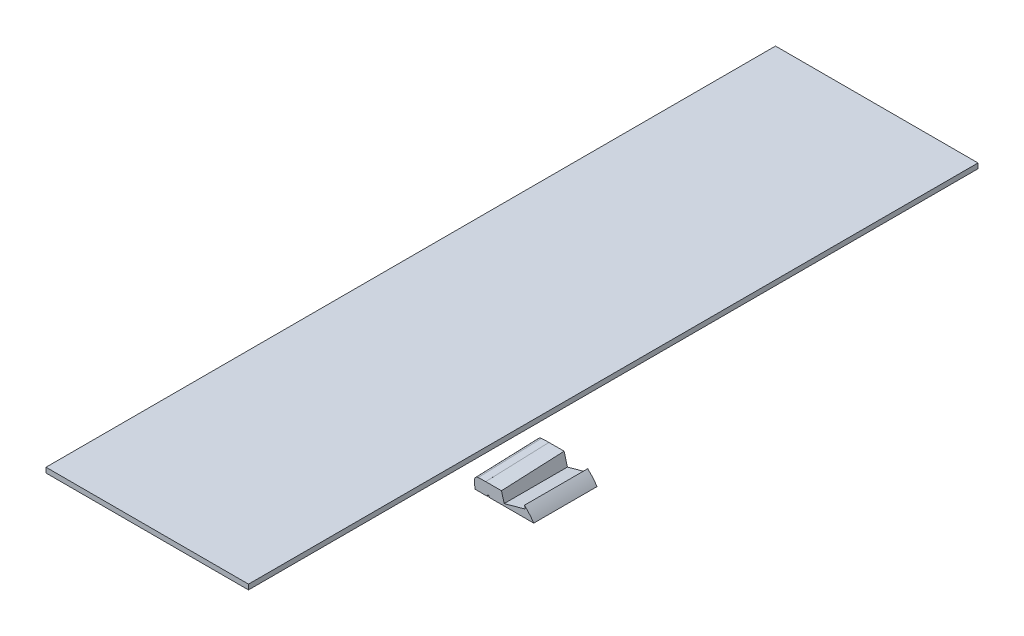
ISO-10303-21;
HEADER;
FILE_DESCRIPTION(('STEP AP214'),'2;1');
FILE_NAME('part.step','',(''),(''),'','','');
FILE_SCHEMA(('AUTOMOTIVE_DESIGN { 1 0 10303 214 1 1 1 1 }'));
ENDSEC;
DATA;
#1=APPLICATION_CONTEXT('core data for automotive mechanical design processes');
#2=APPLICATION_PROTOCOL_DEFINITION('international standard','automotive_design',2000,#1);
#3=PRODUCT_CONTEXT('',#1,'mechanical');
#4=PRODUCT('Part','Part','',(#3));
#5=PRODUCT_RELATED_PRODUCT_CATEGORY('part','',(#4));
#6=PRODUCT_DEFINITION_FORMATION('','',#4);
#7=PRODUCT_DEFINITION_CONTEXT('part definition',#1,'design');
#8=PRODUCT_DEFINITION('design','',#6,#7);
#9=PRODUCT_DEFINITION_SHAPE('','',#8);
#10=(LENGTH_UNIT() NAMED_UNIT(*) SI_UNIT(.MILLI.,.METRE.));
#11=(NAMED_UNIT(*) PLANE_ANGLE_UNIT() SI_UNIT($,.RADIAN.));
#12=(NAMED_UNIT(*) SI_UNIT($,.STERADIAN.) SOLID_ANGLE_UNIT());
#13=UNCERTAINTY_MEASURE_WITH_UNIT(LENGTH_MEASURE(1.E-05),#10,'distance_accuracy_value','');
#14=(GEOMETRIC_REPRESENTATION_CONTEXT(3) GLOBAL_UNCERTAINTY_ASSIGNED_CONTEXT((#13)) GLOBAL_UNIT_ASSIGNED_CONTEXT((#10,
#11,#12)) REPRESENTATION_CONTEXT('',''));
#15=CARTESIAN_POINT('',(0.,0.,0.));
#16=DIRECTION('',(0.,0.,1.));
#17=DIRECTION('',(1.,0.,0.));
#18=AXIS2_PLACEMENT_3D('',#15,#16,#17);
#19=CARTESIAN_POINT('',(38.8064860248671,394.0012038353,482.120102696812));
#20=DIRECTION('',(0.964308162620724,0.2647824909299,0.));
#21=DIRECTION('',(-0.2647824909299,0.964308162620724,0.));
#22=AXIS2_PLACEMENT_3D('',#19,#20,#21);
#23=PLANE('',#22);
#24=DIRECTION('',(0.,0.,1.));
#25=VECTOR('',#24,1.);
#26=CARTESIAN_POINT('',(116.345470624094,111.612910305147,-50.4145633031884));
#27=LINE('',#26,#25);
#28=CARTESIAN_POINT('',(116.345470624094,111.612910305147,-0.906787209581206));
#29=VERTEX_POINT('',#28);
#30=CARTESIAN_POINT('',(116.345470624094,111.612910305147,124.093212790419));
#31=VERTEX_POINT('',#30);
#32=EDGE_CURVE('E598',#29,#31,#27,.T.);
#33=ORIENTED_EDGE('',*,*,#32,.F.);
#34=DIRECTION('',(-0.2647824909299,0.964308162620724,0.));
#35=VECTOR('',#34,1.);
#36=CARTESIAN_POINT('',(38.8064860248671,394.0012038353,-0.906787209581206));
#37=LINE('',#36,#35);
#38=CARTESIAN_POINT('',(109.793096732768,135.475921812285,-0.906787209581227));
#39=VERTEX_POINT('',#38);
#40=EDGE_CURVE('E538',#29,#39,#37,.T.);
#41=ORIENTED_EDGE('',*,*,#40,.T.);
#42=CARTESIAN_POINT('',(109.753405284803,135.620473618277,-5.23468981717832));
#43=CARTESIAN_POINT('',(109.859389161119,135.234492216415,6.36334958936649));
#44=CARTESIAN_POINT('',(109.968473912636,134.837217774529,17.960976204007));
#45=CARTESIAN_POINT('',(110.191608713052,134.024585834063,41.1555083415589));
#46=CARTESIAN_POINT('',(110.305658744404,133.609228399388,52.7524138668736));
#47=CARTESIAN_POINT('',(110.5374882961,132.764931149021,75.9456780913623));
#48=CARTESIAN_POINT('',(110.655267812523,132.33599134761,87.5420367910984));
#49=CARTESIAN_POINT('',(110.893324143082,131.469016866347,110.734387183022));
#50=CARTESIAN_POINT('',(111.013600957132,131.030982186808,122.330378875221));
#51=CARTESIAN_POINT('',(111.255420185839,130.150303652129,145.522173363155));
#52=CARTESIAN_POINT('',(111.376962600501,129.707659796972,157.11797615889));
#53=CARTESIAN_POINT('',(111.620080541348,128.822251498203,180.309571512638));
#54=CARTESIAN_POINT('',(111.741656067517,128.379487054646,191.905364070655));
#55=CARTESIAN_POINT('',(111.983605853896,127.498333043556,215.097182801119));
#56=CARTESIAN_POINT('',(112.103980108491,127.059943496468,226.693208974403));
#57=CARTESIAN_POINT('',(112.342287225985,126.19205567729,249.885598553668));
#58=CARTESIAN_POINT('',(112.460220093464,125.762557388518,261.481961958975));
#59=CARTESIAN_POINT('',(112.692399143381,124.916987304792,284.675195414121));
#60=CARTESIAN_POINT('',(112.806645332728,124.500915484678,296.27206546297));
#61=CARTESIAN_POINT('',(113.030197847382,123.686762275762,319.466482028005));
#62=CARTESIAN_POINT('',(113.139504174712,123.288680879593,331.064028543912));
#63=CARTESIAN_POINT('',(113.351915343806,122.515103202801,354.259971588434));
#64=CARTESIAN_POINT('',(113.455020166764,122.139606990664,365.858368119519));
#65=CARTESIAN_POINT('',(113.653752060195,121.415847703049,389.056177246248));
#66=CARTESIAN_POINT('',(113.749379063485,121.067584872239,400.655589850082));
#67=CARTESIAN_POINT('',(113.840628259898,120.735265523539,412.255506908933));
#68=B_SPLINE_CURVE_WITH_KNOTS('',3,(#42,#43,#44,#45,#46,#47,#48,#49,#50,#51,#52,#53,#54,#55,#56,
#57,#58,#59,#60,#61,#62,#63,#64,#65,#66,#67),.UNSPECIFIED.,.F.,.F.,(4,2,2,2,2,2,2,2,2,2,2,2,4),
(0.,34.8148147103214,69.6295063951828,104.44416147604,139.25881536091,174.073469365323,
208.888107520512,243.702908296918,278.517643749172,313.332313958682,348.146969911807,
382.96173142915,417.776805691255),.UNSPECIFIED.);
#69=CARTESIAN_POINT('',(111.032147749001,130.96343684902,124.093212790419));
#70=VERTEX_POINT('',#69);
#71=EDGE_CURVE('E606',#39,#70,#68,.T.);
#72=ORIENTED_EDGE('',*,*,#71,.T.);
#73=DIRECTION('',(-0.2647824909299,0.964308162620724,0.));
#74=VECTOR('',#73,1.);
#75=CARTESIAN_POINT('',(38.8064860248671,394.0012038353,124.093212790419));
#76=LINE('',#75,#74);
#77=EDGE_CURVE('E569',#31,#70,#76,.T.);
#78=ORIENTED_EDGE('',*,*,#77,.F.);
#79=EDGE_LOOP('',(#33,#41,#72,#78));
#80=FACE_BOUND('',#79,.T.);
#81=ADVANCED_FACE('F341',(#80),#23,.T.);
#82=CARTESIAN_POINT('',(60.399869582043,50.092896258677,-548.050105014357));
#83=DIRECTION('',(0.999405965304478,0.0344632632497941,0.));
#84=DIRECTION('',(-0.0344632632497941,0.999405965304478,0.));
#85=AXIS2_PLACEMENT_3D('',#82,#83,#84);
#86=PLANE('',#85);
#87=DIRECTION('',(-0.0344632632497941,0.999405965304478,0.));
#88=VECTOR('',#87,1.);
#89=CARTESIAN_POINT('',(60.3998695820434,50.092896258677,-0.906787209581261));
#90=LINE('',#89,#88);
#91=CARTESIAN_POINT('',(58.4241385961298,107.387451299709,-0.906787209581261));
#92=VERTEX_POINT('',#91);
#93=CARTESIAN_POINT('',(57.7388846588507,127.259245438914,-0.906787209581261));
#94=VERTEX_POINT('',#93);
#95=EDGE_CURVE('E554',#92,#94,#90,.T.);
#96=ORIENTED_EDGE('',*,*,#95,.F.);
#97=DIRECTION('',(0.,0.,-1.));
#98=VECTOR('',#97,1.);
#99=CARTESIAN_POINT('',(58.4241385961295,107.387451299709,-548.050105014357));
#100=LINE('',#99,#98);
#101=CARTESIAN_POINT('',(58.4241385961295,107.387451299709,124.093212790419));
#102=VERTEX_POINT('',#101);
#103=EDGE_CURVE('E595',#102,#92,#100,.T.);
#104=ORIENTED_EDGE('',*,*,#103,.F.);
#105=DIRECTION('',(-0.0344632632497941,0.999405965304478,0.));
#106=VECTOR('',#105,1.);
#107=CARTESIAN_POINT('',(60.3998695820434,50.092896258677,124.093212790419));
#108=LINE('',#107,#106);
#109=CARTESIAN_POINT('',(57.8925702321294,122.802491660183,124.093212790419));
#110=VERTEX_POINT('',#109);
#111=EDGE_CURVE('E582',#102,#110,#108,.T.);
#112=ORIENTED_EDGE('',*,*,#111,.T.);
#113=DIRECTION('',(-0.00122870293653162,0.0356313630388315,-0.999364246036994));
#114=VECTOR('',#113,1.);
#115=CARTESIAN_POINT('',(57.0704178479695,146.644226877269,-544.603567444162));
#116=LINE('',#115,#114);
#117=EDGE_CURVE('E652',#110,#94,#116,.T.);
#118=ORIENTED_EDGE('',*,*,#117,.T.);
#119=EDGE_LOOP('',(#96,#104,#112,#118));
#120=FACE_BOUND('',#119,.T.);
#121=ADVANCED_FACE('F624',(#120),#86,.F.);
#122=CARTESIAN_POINT('',(155.443997278197,129.814876418465,1178.1644683725));
#123=CARTESIAN_POINT('',(196.657509568503,92.1237405424365,1178.1644683725));
#124=CARTESIAN_POINT('',(192.258596174472,34.9150214858441,1178.1644683725));
#125=B_SPLINE_CURVE_WITH_KNOTS('',2,(#122,#123,#124),.UNSPECIFIED.,.F.,.F.,(3,3),(0.,1.),.UNSPECIFIED.);
#126=DIRECTION('',(0.,0.,-1.));
#127=VECTOR('',#126,1.);
#128=SURFACE_OF_LINEAR_EXTRUSION('',#125,#127);
#129=DIRECTION('',(0.,0.,-1.));
#130=VECTOR('',#129,1.);
#131=CARTESIAN_POINT('',(174.808942224235,107.387451299709,29.6657032982748));
#132=LINE('',#131,#130);
#133=CARTESIAN_POINT('',(174.808942224187,107.387451299782,124.093212790419));
#134=VERTEX_POINT('',#133);
#135=CARTESIAN_POINT('',(174.808942224187,107.387451299782,-0.90678720958115));
#136=VERTEX_POINT('',#135);
#137=EDGE_CURVE('E592',#134,#136,#132,.T.);
#138=ORIENTED_EDGE('',*,*,#137,.T.);
#139=CARTESIAN_POINT('',(155.443997278197,129.814876418465,-0.90678720958115));
#140=CARTESIAN_POINT('',(196.657509568503,92.1237405424365,-0.90678720958115));
#141=CARTESIAN_POINT('',(192.258596174472,34.9150214858441,-0.90678720958115));
#142=B_SPLINE_CURVE_WITH_KNOTS('',2,(#139,#140,#141),.UNSPECIFIED.,.F.,.F.,(3,3),(0.,1.),.UNSPECIFIED.);
#143=CARTESIAN_POINT('',(156.447540783786,128.887901600093,-0.906787209581206));
#144=VERTEX_POINT('',#143);
#145=EDGE_CURVE('E549',#136,#144,#142,.F.);
#146=ORIENTED_EDGE('',*,*,#145,.T.);
#147=DIRECTION('',(0.,0.,-1.));
#148=VECTOR('',#147,1.);
#149=CARTESIAN_POINT('',(156.447540783786,128.887901600093,-18.0163537751292));
#150=LINE('',#149,#148);
#151=CARTESIAN_POINT('',(156.447540783786,128.887901600093,124.093212790419));
#152=VERTEX_POINT('',#151);
#153=EDGE_CURVE('E603',#152,#144,#150,.T.);
#154=ORIENTED_EDGE('',*,*,#153,.F.);
#155=CARTESIAN_POINT('',(155.443997278197,129.814876418465,124.093212790419));
#156=CARTESIAN_POINT('',(196.657509568503,92.1237405424365,124.093212790419));
#157=CARTESIAN_POINT('',(192.258596174472,34.9150214858441,124.093212790419));
#158=B_SPLINE_CURVE_WITH_KNOTS('',2,(#155,#156,#157),.UNSPECIFIED.,.F.,.F.,(3,3),(0.,1.),.UNSPECIFIED.);
#159=EDGE_CURVE('E565',#134,#152,#158,.F.);
#160=ORIENTED_EDGE('',*,*,#159,.F.);
#161=EDGE_LOOP('',(#138,#146,#154,#160));
#162=FACE_BOUND('',#161,.T.);
#163=ADVANCED_FACE('F630',(#162),#128,.T.);
#164=CARTESIAN_POINT('',(0.,107.387451299709,0.));
#165=DIRECTION('',(0.,-1.,0.));
#166=DIRECTION('',(0.,0.,-1.));
#167=AXIS2_PLACEMENT_3D('',#164,#165,#166);
#168=PLANE('',#167);
#169=DIRECTION('',(0.,0.,-1.));
#170=VECTOR('',#169,1.);
#171=CARTESIAN_POINT('',(85.608617664449,107.387451299709,4.09321279041879));
#172=LINE('',#171,#170);
#173=CARTESIAN_POINT('',(85.608617664449,107.387451299709,4.09321279041879));
#174=VERTEX_POINT('',#173);
#175=CARTESIAN_POINT('',(85.608617664449,107.387451299709,-0.906787209581206));
#176=VERTEX_POINT('',#175);
#177=EDGE_CURVE('E469',#174,#176,#172,.T.);
#178=ORIENTED_EDGE('',*,*,#177,.T.);
#179=DIRECTION('',(1.,0.,0.));
#180=VECTOR('',#179,1.);
#181=CARTESIAN_POINT('',(0.,107.387451299709,-0.906787209581206));
#182=LINE('',#181,#180);
#183=EDGE_CURVE('E559',#176,#136,#182,.T.);
#184=ORIENTED_EDGE('',*,*,#183,.T.);
#185=ORIENTED_EDGE('',*,*,#137,.F.);
#186=DIRECTION('',(1.,0.,0.));
#187=VECTOR('',#186,1.);
#188=CARTESIAN_POINT('',(0.,107.387451299709,124.093212790419));
#189=LINE('',#188,#187);
#190=CARTESIAN_POINT('',(86.2281431725654,107.387451299709,124.093212790419));
#191=VERTEX_POINT('',#190);
#192=EDGE_CURVE('E578',#191,#134,#189,.T.);
#193=ORIENTED_EDGE('',*,*,#192,.F.);
#194=DIRECTION('',(0.,0.,1.));
#195=VECTOR('',#194,1.);
#196=CARTESIAN_POINT('',(86.2281431725654,107.387451299709,119.093212790419));
#197=LINE('',#196,#195);
#198=CARTESIAN_POINT('',(86.2281431725654,107.387451299709,119.093212790419));
#199=VERTEX_POINT('',#198);
#200=EDGE_CURVE('E526',#199,#191,#197,.T.);
#201=ORIENTED_EDGE('',*,*,#200,.F.);
#202=DIRECTION('',(1.,0.,0.));
#203=VECTOR('',#202,1.);
#204=CARTESIAN_POINT('',(83.2281431725654,107.387451299709,119.093212790419));
#205=LINE('',#204,#203);
#206=CARTESIAN_POINT('',(83.2281431725654,107.387451299709,119.093212790419));
#207=VERTEX_POINT('',#206);
#208=EDGE_CURVE('E517',#207,#199,#205,.T.);
#209=ORIENTED_EDGE('',*,*,#208,.F.);
#210=DIRECTION('',(0.,0.,1.));
#211=VECTOR('',#210,1.);
#212=CARTESIAN_POINT('',(83.2281431725654,107.387451299709,119.093212790419));
#213=LINE('',#212,#211);
#214=CARTESIAN_POINT('',(83.2281431725654,107.387451299709,124.093212790419));
#215=VERTEX_POINT('',#214);
#216=EDGE_CURVE('E529',#207,#215,#213,.T.);
#217=ORIENTED_EDGE('',*,*,#216,.T.);
#218=EDGE_CURVE('E579',#102,#215,#189,.T.);
#219=ORIENTED_EDGE('',*,*,#218,.F.);
#220=ORIENTED_EDGE('',*,*,#103,.T.);
#221=CARTESIAN_POINT('',(82.608617664449,107.387451299709,-0.906787209581206));
#222=VERTEX_POINT('',#221);
#223=EDGE_CURVE('E560',#92,#222,#182,.T.);
#224=ORIENTED_EDGE('',*,*,#223,.T.);
#225=DIRECTION('',(0.,0.,-1.));
#226=VECTOR('',#225,1.);
#227=CARTESIAN_POINT('',(82.608617664449,107.387451299709,4.09321279041879));
#228=LINE('',#227,#226);
#229=CARTESIAN_POINT('',(82.608617664449,107.387451299709,4.09321279041879));
#230=VERTEX_POINT('',#229);
#231=EDGE_CURVE('E356',#230,#222,#228,.T.);
#232=ORIENTED_EDGE('',*,*,#231,.F.);
#233=DIRECTION('',(-1.,0.,0.));
#234=VECTOR('',#233,1.);
#235=CARTESIAN_POINT('',(85.608617664449,107.387451299709,4.09321279041879));
#236=LINE('',#235,#234);
#237=EDGE_CURVE('E486',#174,#230,#236,.T.);
#238=ORIENTED_EDGE('',*,*,#237,.F.);
#239=EDGE_LOOP('',(#178,#184,#185,#193,#201,#209,#217,#219,#220,#224,#232,#238));
#240=FACE_BOUND('',#239,.T.);
#241=ADVANCED_FACE('F489',(#240),#168,.T.);
#242=CARTESIAN_POINT('',(162.161570526622,108.078045543812,482.120102696812));
#243=DIRECTION('',(0.964308162620724,0.2647824909299,0.));
#244=DIRECTION('',(-0.2647824909299,0.964308162620724,0.));
#245=AXIS2_PLACEMENT_3D('',#242,#243,#244);
#246=PLANE('',#245);
#247=DIRECTION('',(-0.2647824909299,0.964308162620724,0.));
#248=VECTOR('',#247,1.);
#249=CARTESIAN_POINT('',(162.161570526622,108.078045543812,-0.906787209581206));
#250=LINE('',#249,#248);
#251=CARTESIAN_POINT('',(158.046850617572,123.063394390939,-0.906787209581206));
#252=VERTEX_POINT('',#251);
#253=EDGE_CURVE('E547',#252,#144,#250,.T.);
#254=ORIENTED_EDGE('',*,*,#253,.F.);
#255=DIRECTION('',(0.,0.,-1.));
#256=VECTOR('',#255,1.);
#257=CARTESIAN_POINT('',(158.046850617572,123.063394390938,-50.4145633031884));
#258=LINE('',#257,#256);
#259=CARTESIAN_POINT('',(158.046850617572,123.063394390938,124.093212790419));
#260=VERTEX_POINT('',#259);
#261=EDGE_CURVE('E600',#260,#252,#258,.T.);
#262=ORIENTED_EDGE('',*,*,#261,.F.);
#263=DIRECTION('',(-0.2647824909299,0.964308162620724,0.));
#264=VECTOR('',#263,1.);
#265=CARTESIAN_POINT('',(162.161570526622,108.078045543812,124.093212790419));
#266=LINE('',#265,#264);
#267=EDGE_CURVE('E562',#260,#152,#266,.T.);
#268=ORIENTED_EDGE('',*,*,#267,.T.);
#269=ORIENTED_EDGE('',*,*,#153,.T.);
#270=EDGE_LOOP('',(#254,#262,#268,#269));
#271=FACE_BOUND('',#270,.T.);
#272=ADVANCED_FACE('F626',(#271),#246,.F.);
#273=CARTESIAN_POINT('',(-321.200733720247,120.735265523539,412.255506908933));
#274=CARTESIAN_POINT('',(-321.200733720247,126.459976930153,212.424074831064));
#275=CARTESIAN_POINT('',(-321.200733720247,140.766819561367,-62.0318859574016));
#276=CARTESIAN_POINT('',(-321.200733720247,142.224095205381,-367.378936481385));
#277=CARTESIAN_POINT('',(-321.200733720247,150.388874092584,-474.702692901168));
#278=CARTESIAN_POINT('',(-321.200733720247,167.203516207955,-505.045548771997));
#279=B_SPLINE_CURVE_WITH_KNOTS('',3,(#273,#274,#275,#276,#277,#278),.UNSPECIFIED.,.F.,.F.,(4,1,
1,4),(0.,0.65432029386997,0.889445498951443,1.),.UNSPECIFIED.);
#280=DIRECTION('',(1.,0.,0.));
#281=VECTOR('',#280,1.);
#282=SURFACE_OF_LINEAR_EXTRUSION('',#279,#281);
#283=DIRECTION('',(1.,0.,0.));
#284=VECTOR('',#283,1.);
#285=CARTESIAN_POINT('',(95.4044367211003,135.475921812285,-0.906787209581227));
#286=LINE('',#285,#284);
#287=CARTESIAN_POINT('',(79.7817103812201,135.475921812285,-0.906787209581206));
#288=VERTEX_POINT('',#287);
#289=EDGE_CURVE('E536',#288,#39,#286,.T.);
#290=ORIENTED_EDGE('',*,*,#289,.F.);
#291=CARTESIAN_POINT('',(80.2900234549761,120.735265523539,412.255506908933));
#292=CARTESIAN_POINT('',(80.278564041773,121.067578973693,400.655794392538));
#293=CARTESIAN_POINT('',(80.2665548199383,121.415836416795,389.056551535654));
#294=CARTESIAN_POINT('',(80.2415972040777,122.13958651527,365.859011844279));
#295=CARTESIAN_POINT('',(80.2286488179084,122.515078942813,354.260715002685));
#296=CARTESIAN_POINT('',(80.2019731590427,123.288650859249,331.064912745115));
#297=CARTESIAN_POINT('',(80.1882458885456,123.686730284366,319.467407326995));
#298=CARTESIAN_POINT('',(80.1601709113265,124.500881268998,296.273026338555));
#299=CARTESIAN_POINT('',(80.1458232043681,124.916952835373,284.676150768476));
#300=CARTESIAN_POINT('',(80.1166647459532,125.76252387337,261.482871361706));
#301=CARTESIAN_POINT('',(80.1018539936888,126.192023368423,249.886467525874));
#302=CARTESIAN_POINT('',(80.0719258491185,127.059914664648,226.69397385276));
#303=CARTESIAN_POINT('',(80.0568084562769,127.498306481357,215.097884016062));
#304=CARTESIAN_POINT('',(80.0264227812028,128.379465781585,191.905921871479));
#305=CARTESIAN_POINT('',(80.011154499627,128.822233246065,180.310049562866));
#306=CARTESIAN_POINT('',(79.9806220940239,129.707647609577,157.118295414693));
#307=CARTESIAN_POINT('',(79.9653579699983,130.150294508559,145.522413575131));
#308=CARTESIAN_POINT('',(79.9349886820465,131.030978595875,122.330474013774));
#309=CARTESIAN_POINT('',(79.9198835181197,131.469015784225,110.734416291979));
#310=CARTESIAN_POINT('',(79.8899868515431,132.33599424482,87.5419591268399));
#311=CARTESIAN_POINT('',(79.8751953489032,132.764935516774,75.9455596834848));
#312=CARTESIAN_POINT('',(79.846080764425,133.609234247106,52.7522516502531));
#313=CARTESIAN_POINT('',(79.8317576830452,134.024591692184,41.155343059889));
#314=CARTESIAN_POINT('',(79.8037351454436,134.837221971533,17.9608544875777));
#315=CARTESIAN_POINT('',(79.790035691274,135.234494746294,6.3632745035468));
#316=CARTESIAN_POINT('',(79.7767256931993,135.620473618277,-5.23468981717825));
#317=B_SPLINE_CURVE_WITH_KNOTS('',3,(#291,#292,#293,#294,#295,#296,#297,#298,#299,#300,#301,
#302,#303,#304,#305,#306,#307,#308,#309,#310,#311,#312,#313,#314,#315,#316),.UNSPECIFIED.,.F.,
.F.,(4,2,2,2,2,2,2,2,2,2,2,2,4),(0.,34.8134032424337,69.626515291114,104.439529045767,
139.252556073134,174.065643849868,208.878792453331,243.691789635283,278.504801575262,
313.317813403808,348.13082634597,382.943873371801,417.757034950176),.UNSPECIFIED.);
#318=CARTESIAN_POINT('',(79.9074016659327,131.830979114376,101.050475687934));
#319=VERTEX_POINT('',#318);
#320=EDGE_CURVE('E653',#319,#288,#317,.T.);
#321=ORIENTED_EDGE('',*,*,#320,.F.);
#322=CARTESIAN_POINT('',(79.9373177746105,130.96343684902,124.093212790419));
#323=VERTEX_POINT('',#322);
#324=EDGE_CURVE('E647',#323,#319,#317,.T.);
#325=ORIENTED_EDGE('',*,*,#324,.F.);
#326=DIRECTION('',(1.,0.,0.));
#327=VECTOR('',#326,1.);
#328=CARTESIAN_POINT('',(96.377446909269,130.96343684902,124.093212790419));
#329=LINE('',#328,#327);
#330=EDGE_CURVE('E575',#323,#70,#329,.T.);
#331=ORIENTED_EDGE('',*,*,#330,.T.);
#332=ORIENTED_EDGE('',*,*,#71,.F.);
#333=EDGE_LOOP('',(#290,#321,#325,#331,#332));
#334=FACE_BOUND('',#333,.T.);
#335=ADVANCED_FACE('F616',(#334),#282,.F.);
#336=CARTESIAN_POINT('',(57.9903730947071,119.966290004659,412.255506908934));
#337=DIRECTION('',(0.0344413530936049,-0.998770589001383,-0.0356525418856952));
#338=DIRECTION('',(0.,0.0356737063605036,-0.999363490765249));
#339=AXIS2_PLACEMENT_3D('',#336,#337,#338);
#340=PLANE('',#339);
#341=DIRECTION('',(0.999405965304478,0.0344632632497941,0.));
#342=VECTOR('',#341,1.);
#343=CARTESIAN_POINT('',(57.4823964224773,134.697190928994,-0.906787209581206));
#344=LINE('',#343,#342);
#345=CARTESIAN_POINT('',(64.9156132092344,134.953516101954,-0.906787209581261));
#346=VERTEX_POINT('',#345);
#347=CARTESIAN_POINT('',(79.7820467827476,135.466166447876,-0.906787209581233));
#348=VERTEX_POINT('',#347);
#349=EDGE_CURVE('E528',#346,#348,#344,.T.);
#350=ORIENTED_EDGE('',*,*,#349,.F.);
#351=DIRECTION('',(-0.00122870293653162,0.0356313630388315,-0.999364246036994));
#352=VECTOR('',#351,1.);
#353=CARTESIAN_POINT('',(65.4235898814645,120.22261517762,412.255506908934));
#354=LINE('',#353,#352);
#355=CARTESIAN_POINT('',(65.0692987825131,130.496762323224,124.093212790419));
#356=VERTEX_POINT('',#355);
#357=EDGE_CURVE('E669',#346,#356,#354,.F.);
#358=ORIENTED_EDGE('',*,*,#357,.T.);
#359=DIRECTION('',(0.999405965304478,0.0344632632497941,0.));
#360=VECTOR('',#359,1.);
#361=CARTESIAN_POINT('',(57.636081995756,130.240437150263,124.093212790419));
#362=LINE('',#361,#360);
#363=CARTESIAN_POINT('',(79.9357323560279,131.009412669145,124.093212790419));
#364=VERTEX_POINT('',#363);
#365=EDGE_CURVE('E587',#356,#364,#362,.T.);
#366=ORIENTED_EDGE('',*,*,#365,.T.);
#367=DIRECTION('',(-0.00122870293653165,0.0356313630388315,-0.999364246036994));
#368=VECTOR('',#367,1.);
#369=CARTESIAN_POINT('',(80.2900234549792,120.735265523542,412.255506908934));
#370=LINE('',#369,#368);
#371=EDGE_CURVE('E614',#364,#319,#370,.T.);
#372=ORIENTED_EDGE('',*,*,#371,.T.);
#373=EDGE_CURVE('E613',#319,#348,#370,.T.);
#374=ORIENTED_EDGE('',*,*,#373,.T.);
#375=EDGE_LOOP('',(#350,#358,#366,#372,#374));
#376=FACE_BOUND('',#375,.T.);
#377=ADVANCED_FACE('F638',(#376),#340,.F.);
#378=CARTESIAN_POINT('',(64.5036346347269,146.900552050229,-544.603567444162));
#379=DIRECTION('',(-0.00122870293653162,0.0356313630388315,-0.999364246036994));
#380=DIRECTION('',(0.,0.999365000413399,0.0356313899353906));
#381=AXIS2_PLACEMENT_3D('',#378,#379,#380);
#382=CYLINDRICAL_SURFACE('',#381,7.437635);
#383=ORIENTED_EDGE('',*,*,#357,.F.);
#384=CARTESIAN_POINT('',(65.172101445608,127.515570611875,-0.906787209581261));
#385=DIRECTION('',(0.,0.,-1.));
#386=DIRECTION('',(-0.0344632632498107,0.999405965304477,0.));
#387=AXIS2_PLACEMENT_3D('',#384,#385,#386);
#388=ELLIPSE('',#387,7.44236651400542,7.437635);
#389=EDGE_CURVE('E544',#346,#94,#388,.F.);
#390=ORIENTED_EDGE('',*,*,#389,.T.);
#391=ORIENTED_EDGE('',*,*,#117,.F.);
#392=CARTESIAN_POINT('',(65.3257870188868,123.058816833144,124.093212790419));
#393=DIRECTION('',(0.,0.,-1.));
#394=DIRECTION('',(-0.0344632632498107,0.999405965304477,0.));
#395=AXIS2_PLACEMENT_3D('',#392,#393,#394);
#396=ELLIPSE('',#395,7.44236651400542,7.437635);
#397=EDGE_CURVE('E585',#356,#110,#396,.F.);
#398=ORIENTED_EDGE('',*,*,#397,.F.);
#399=EDGE_LOOP('',(#383,#390,#391,#398));
#400=FACE_BOUND('',#399,.T.);
#401=ADVANCED_FACE('F343',(#400),#382,.T.);
#402=CARTESIAN_POINT('',(-20.3413844906981,74.0810430270476,0.));
#403=DIRECTION('',(-0.2647824909299,0.964308162620724,0.));
#404=DIRECTION('',(-0.964308162620724,-0.2647824909299,0.));
#405=AXIS2_PLACEMENT_3D('',#402,#403,#404);
#406=PLANE('',#405);
#407=ORIENTED_EDGE('',*,*,#261,.T.);
#408=DIRECTION('',(-0.964308162620724,-0.2647824909299,0.));
#409=VECTOR('',#408,1.);
#410=CARTESIAN_POINT('',(-20.3413844906981,74.0810430270476,-0.906787209581206));
#411=LINE('',#410,#409);
#412=EDGE_CURVE('E541',#252,#29,#411,.T.);
#413=ORIENTED_EDGE('',*,*,#412,.T.);
#414=ORIENTED_EDGE('',*,*,#32,.T.);
#415=DIRECTION('',(-0.964308162620724,-0.2647824909299,0.));
#416=VECTOR('',#415,1.);
#417=CARTESIAN_POINT('',(-20.3413844906981,74.0810430270476,124.093212790419));
#418=LINE('',#417,#416);
#419=EDGE_CURVE('E349',#260,#31,#418,.T.);
#420=ORIENTED_EDGE('',*,*,#419,.F.);
#421=EDGE_LOOP('',(#407,#413,#414,#420));
#422=FACE_BOUND('',#421,.T.);
#423=ADVANCED_FACE('F644',(#422),#406,.T.);
#424=CARTESIAN_POINT('',(79.5934517566759,140.935265317445,459.688927372495));
#425=DIRECTION('',(-0.999405965304477,-0.0344632632498151,0.));
#426=DIRECTION('',(0.0344632632498151,-0.999405965304477,0.));
#427=AXIS2_PLACEMENT_3D('',#424,#425,#426);
#428=PLANE('',#427);
#429=ORIENTED_EDGE('',*,*,#320,.T.);
#430=DIRECTION('',(0.0344632632498151,-0.999405965304477,0.));
#431=VECTOR('',#430,1.);
#432=CARTESIAN_POINT('',(79.5934517566759,140.935265317445,-0.906787209581206));
#433=LINE('',#432,#431);
#434=EDGE_CURVE('E14',#288,#348,#433,.T.);
#435=ORIENTED_EDGE('',*,*,#434,.T.);
#436=ORIENTED_EDGE('',*,*,#373,.F.);
#437=EDGE_LOOP('',(#429,#435,#436));
#438=FACE_BOUND('',#437,.T.);
#439=ADVANCED_FACE('F636',(#438),#428,.T.);
#440=CARTESIAN_POINT('',(82.6995199423151,50.8618717775596,-548.050105014357));
#441=DIRECTION('',(0.999405965304478,0.0344632632497941,0.));
#442=DIRECTION('',(-0.0344632632497941,0.999405965304478,0.));
#443=AXIS2_PLACEMENT_3D('',#440,#441,#442);
#444=PLANE('',#443);
#445=DIRECTION('',(-0.0344632632497941,0.999405965304478,0.));
#446=VECTOR('',#445,1.);
#447=CARTESIAN_POINT('',(82.6995199423155,50.8618717775596,124.093212790419));
#448=LINE('',#447,#446);
#449=EDGE_CURVE('E590',#323,#364,#448,.T.);
#450=ORIENTED_EDGE('',*,*,#449,.F.);
#451=ORIENTED_EDGE('',*,*,#324,.T.);
#452=ORIENTED_EDGE('',*,*,#371,.F.);
#453=EDGE_LOOP('',(#450,#451,#452));
#454=FACE_BOUND('',#453,.T.);
#455=ADVANCED_FACE('F632',(#454),#444,.T.);
#456=CARTESIAN_POINT('',(0.,0.,124.093212790419));
#457=DIRECTION('',(0.,0.,-1.));
#458=DIRECTION('',(-1.,0.,0.));
#459=AXIS2_PLACEMENT_3D('',#456,#457,#458);
#460=PLANE('',#459);
#461=DIRECTION('',(-1.,0.,0.));
#462=VECTOR('',#461,1.);
#463=CARTESIAN_POINT('',(83.2281431725654,110.387451299709,124.093212790419));
#464=LINE('',#463,#462);
#465=CARTESIAN_POINT('',(86.2281431725654,110.387451299709,124.093212790419));
#466=VERTEX_POINT('',#465);
#467=CARTESIAN_POINT('',(83.2281431725654,110.387451299709,124.093212790419));
#468=VERTEX_POINT('',#467);
#469=EDGE_CURVE('E522',#466,#468,#464,.T.);
#470=ORIENTED_EDGE('',*,*,#469,.F.);
#471=DIRECTION('',(0.,1.,0.));
#472=VECTOR('',#471,1.);
#473=CARTESIAN_POINT('',(86.2281431725654,107.387451299709,124.093212790419));
#474=LINE('',#473,#472);
#475=EDGE_CURVE('E364',#191,#466,#474,.T.);
#476=ORIENTED_EDGE('',*,*,#475,.F.);
#477=ORIENTED_EDGE('',*,*,#192,.T.);
#478=ORIENTED_EDGE('',*,*,#159,.T.);
#479=ORIENTED_EDGE('',*,*,#267,.F.);
#480=ORIENTED_EDGE('',*,*,#419,.T.);
#481=ORIENTED_EDGE('',*,*,#77,.T.);
#482=ORIENTED_EDGE('',*,*,#330,.F.);
#483=ORIENTED_EDGE('',*,*,#449,.T.);
#484=ORIENTED_EDGE('',*,*,#365,.F.);
#485=ORIENTED_EDGE('',*,*,#397,.T.);
#486=ORIENTED_EDGE('',*,*,#111,.F.);
#487=ORIENTED_EDGE('',*,*,#218,.T.);
#488=DIRECTION('',(0.,-1.,0.));
#489=VECTOR('',#488,1.);
#490=CARTESIAN_POINT('',(83.2281431725654,107.387451299709,124.093212790419));
#491=LINE('',#490,#489);
#492=EDGE_CURVE('E511',#468,#215,#491,.T.);
#493=ORIENTED_EDGE('',*,*,#492,.F.);
#494=EDGE_LOOP('',(#470,#476,#477,#478,#479,#480,#481,#482,#483,#484,#485,#486,#487,#493));
#495=FACE_BOUND('',#494,.T.);
#496=ADVANCED_FACE('F635',(#495),#460,.F.);
#497=CARTESIAN_POINT('',(0.,0.,-0.906787209581206));
#498=DIRECTION('',(0.,0.,-1.));
#499=DIRECTION('',(-1.,0.,0.));
#500=AXIS2_PLACEMENT_3D('',#497,#498,#499);
#501=PLANE('',#500);
#502=DIRECTION('',(0.,1.,0.));
#503=VECTOR('',#502,1.);
#504=CARTESIAN_POINT('',(82.608617664449,107.387451299709,-0.906787209581206));
#505=LINE('',#504,#503);
#506=CARTESIAN_POINT('',(82.608617664449,110.387451299709,-0.906787209581206));
#507=VERTEX_POINT('',#506);
#508=EDGE_CURVE('E498',#222,#507,#505,.T.);
#509=ORIENTED_EDGE('',*,*,#508,.F.);
#510=ORIENTED_EDGE('',*,*,#223,.F.);
#511=ORIENTED_EDGE('',*,*,#95,.T.);
#512=ORIENTED_EDGE('',*,*,#389,.F.);
#513=ORIENTED_EDGE('',*,*,#349,.T.);
#514=ORIENTED_EDGE('',*,*,#434,.F.);
#515=ORIENTED_EDGE('',*,*,#289,.T.);
#516=ORIENTED_EDGE('',*,*,#40,.F.);
#517=ORIENTED_EDGE('',*,*,#412,.F.);
#518=ORIENTED_EDGE('',*,*,#253,.T.);
#519=ORIENTED_EDGE('',*,*,#145,.F.);
#520=ORIENTED_EDGE('',*,*,#183,.F.);
#521=DIRECTION('',(0.,-1.,0.));
#522=VECTOR('',#521,1.);
#523=CARTESIAN_POINT('',(85.608617664449,107.387451299709,-0.906787209581206));
#524=LINE('',#523,#522);
#525=CARTESIAN_POINT('',(85.608617664449,110.387451299709,-0.906787209581206));
#526=VERTEX_POINT('',#525);
#527=EDGE_CURVE('E476',#526,#176,#524,.T.);
#528=ORIENTED_EDGE('',*,*,#527,.F.);
#529=DIRECTION('',(1.,0.,0.));
#530=VECTOR('',#529,1.);
#531=CARTESIAN_POINT('',(85.608617664449,110.387451299709,-0.906787209581206));
#532=LINE('',#531,#530);
#533=EDGE_CURVE('E504',#507,#526,#532,.T.);
#534=ORIENTED_EDGE('',*,*,#533,.F.);
#535=EDGE_LOOP('',(#509,#510,#511,#512,#513,#514,#515,#516,#517,#518,#519,#520,#528,#534));
#536=FACE_BOUND('',#535,.T.);
#537=ADVANCED_FACE('F693',(#536),#501,.T.);
#538=CARTESIAN_POINT('',(86.2281431725654,107.387451299709,119.093212790419));
#539=DIRECTION('',(1.,0.,0.));
#540=DIRECTION('',(0.,0.,-1.));
#541=AXIS2_PLACEMENT_3D('',#538,#539,#540);
#542=PLANE('',#541);
#543=ORIENTED_EDGE('',*,*,#475,.T.);
#544=DIRECTION('',(0.,0.,1.));
#545=VECTOR('',#544,1.);
#546=CARTESIAN_POINT('',(86.2281431725654,110.387451299709,119.093212790419));
#547=LINE('',#546,#545);
#548=CARTESIAN_POINT('',(86.2281431725654,110.387451299709,119.093212790419));
#549=VERTEX_POINT('',#548);
#550=EDGE_CURVE('E520',#549,#466,#547,.T.);
#551=ORIENTED_EDGE('',*,*,#550,.F.);
#552=DIRECTION('',(0.,1.,0.));
#553=VECTOR('',#552,1.);
#554=CARTESIAN_POINT('',(86.2281431725654,107.387451299709,119.093212790419));
#555=LINE('',#554,#553);
#556=EDGE_CURVE('E507',#199,#549,#555,.T.);
#557=ORIENTED_EDGE('',*,*,#556,.F.);
#558=ORIENTED_EDGE('',*,*,#200,.T.);
#559=EDGE_LOOP('',(#543,#551,#557,#558));
#560=FACE_BOUND('',#559,.T.);
#561=ADVANCED_FACE('F738',(#560),#542,.F.);
#562=CARTESIAN_POINT('',(83.2281431725654,107.387451299709,119.093212790419));
#563=DIRECTION('',(-1.,0.,0.));
#564=DIRECTION('',(0.,0.,1.));
#565=AXIS2_PLACEMENT_3D('',#562,#563,#564);
#566=PLANE('',#565);
#567=ORIENTED_EDGE('',*,*,#492,.T.);
#568=ORIENTED_EDGE('',*,*,#216,.F.);
#569=DIRECTION('',(0.,-1.,0.));
#570=VECTOR('',#569,1.);
#571=CARTESIAN_POINT('',(83.2281431725654,107.387451299709,119.093212790419));
#572=LINE('',#571,#570);
#573=CARTESIAN_POINT('',(83.2281431725654,110.387451299709,119.093212790419));
#574=VERTEX_POINT('',#573);
#575=EDGE_CURVE('E514',#574,#207,#572,.T.);
#576=ORIENTED_EDGE('',*,*,#575,.F.);
#577=DIRECTION('',(0.,0.,1.));
#578=VECTOR('',#577,1.);
#579=CARTESIAN_POINT('',(83.2281431725654,110.387451299709,119.093212790419));
#580=LINE('',#579,#578);
#581=EDGE_CURVE('E532',#574,#468,#580,.T.);
#582=ORIENTED_EDGE('',*,*,#581,.T.);
#583=EDGE_LOOP('',(#567,#568,#576,#582));
#584=FACE_BOUND('',#583,.T.);
#585=ADVANCED_FACE('F705',(#584),#566,.F.);
#586=CARTESIAN_POINT('',(83.2281431725654,110.387451299709,119.093212790419));
#587=DIRECTION('',(0.,1.,0.));
#588=DIRECTION('',(0.,0.,1.));
#589=AXIS2_PLACEMENT_3D('',#586,#587,#588);
#590=PLANE('',#589);
#591=ORIENTED_EDGE('',*,*,#469,.T.);
#592=ORIENTED_EDGE('',*,*,#581,.F.);
#593=DIRECTION('',(-1.,0.,0.));
#594=VECTOR('',#593,1.);
#595=CARTESIAN_POINT('',(83.2281431725654,110.387451299709,119.093212790419));
#596=LINE('',#595,#594);
#597=EDGE_CURVE('E510',#549,#574,#596,.T.);
#598=ORIENTED_EDGE('',*,*,#597,.F.);
#599=ORIENTED_EDGE('',*,*,#550,.T.);
#600=EDGE_LOOP('',(#591,#592,#598,#599));
#601=FACE_BOUND('',#600,.T.);
#602=ADVANCED_FACE('F710',(#601),#590,.F.);
#603=CARTESIAN_POINT('',(0.,0.,119.093212790419));
#604=DIRECTION('',(0.,0.,-1.));
#605=DIRECTION('',(-1.,0.,0.));
#606=AXIS2_PLACEMENT_3D('',#603,#604,#605);
#607=PLANE('',#606);
#608=ORIENTED_EDGE('',*,*,#556,.T.);
#609=ORIENTED_EDGE('',*,*,#597,.T.);
#610=ORIENTED_EDGE('',*,*,#575,.T.);
#611=ORIENTED_EDGE('',*,*,#208,.T.);
#612=EDGE_LOOP('',(#608,#609,#610,#611));
#613=FACE_BOUND('',#612,.T.);
#614=ADVANCED_FACE('F707',(#613),#607,.F.);
#615=CARTESIAN_POINT('',(85.608617664449,110.387451299709,4.09321279041879));
#616=DIRECTION('',(1.,0.,0.));
#617=DIRECTION('',(0.,0.,-1.));
#618=AXIS2_PLACEMENT_3D('',#615,#616,#617);
#619=PLANE('',#618);
#620=ORIENTED_EDGE('',*,*,#527,.T.);
#621=ORIENTED_EDGE('',*,*,#177,.F.);
#622=DIRECTION('',(0.,-1.,0.));
#623=VECTOR('',#622,1.);
#624=CARTESIAN_POINT('',(85.608617664449,110.387451299709,4.09321279041879));
#625=LINE('',#624,#623);
#626=CARTESIAN_POINT('',(85.608617664449,110.387451299709,4.09321279041879));
#627=VERTEX_POINT('',#626);
#628=EDGE_CURVE('E473',#627,#174,#625,.T.);
#629=ORIENTED_EDGE('',*,*,#628,.F.);
#630=DIRECTION('',(0.,0.,-1.));
#631=VECTOR('',#630,1.);
#632=CARTESIAN_POINT('',(85.608617664449,110.387451299709,4.09321279041879));
#633=LINE('',#632,#631);
#634=EDGE_CURVE('E496',#627,#526,#633,.T.);
#635=ORIENTED_EDGE('',*,*,#634,.T.);
#636=EDGE_LOOP('',(#620,#621,#629,#635));
#637=FACE_BOUND('',#636,.T.);
#638=ADVANCED_FACE('F471',(#637),#619,.F.);
#639=CARTESIAN_POINT('',(85.608617664449,110.387451299709,4.09321279041879));
#640=DIRECTION('',(0.,1.,0.));
#641=DIRECTION('',(0.,0.,1.));
#642=AXIS2_PLACEMENT_3D('',#639,#640,#641);
#643=PLANE('',#642);
#644=ORIENTED_EDGE('',*,*,#533,.T.);
#645=ORIENTED_EDGE('',*,*,#634,.F.);
#646=DIRECTION('',(1.,0.,0.));
#647=VECTOR('',#646,1.);
#648=CARTESIAN_POINT('',(85.608617664449,110.387451299709,4.09321279041879));
#649=LINE('',#648,#647);
#650=CARTESIAN_POINT('',(82.608617664449,110.387451299709,4.09321279041879));
#651=VERTEX_POINT('',#650);
#652=EDGE_CURVE('E480',#651,#627,#649,.T.);
#653=ORIENTED_EDGE('',*,*,#652,.F.);
#654=DIRECTION('',(0.,0.,-1.));
#655=VECTOR('',#654,1.);
#656=CARTESIAN_POINT('',(82.608617664449,110.387451299709,4.09321279041879));
#657=LINE('',#656,#655);
#658=EDGE_CURVE('E499',#651,#507,#657,.T.);
#659=ORIENTED_EDGE('',*,*,#658,.T.);
#660=EDGE_LOOP('',(#644,#645,#653,#659));
#661=FACE_BOUND('',#660,.T.);
#662=ADVANCED_FACE('F721',(#661),#643,.F.);
#663=CARTESIAN_POINT('',(82.608617664449,110.387451299709,4.09321279041879));
#664=DIRECTION('',(-1.,0.,0.));
#665=DIRECTION('',(0.,0.,1.));
#666=AXIS2_PLACEMENT_3D('',#663,#664,#665);
#667=PLANE('',#666);
#668=ORIENTED_EDGE('',*,*,#508,.T.);
#669=ORIENTED_EDGE('',*,*,#658,.F.);
#670=DIRECTION('',(0.,1.,0.));
#671=VECTOR('',#670,1.);
#672=CARTESIAN_POINT('',(82.608617664449,110.387451299709,4.09321279041879));
#673=LINE('',#672,#671);
#674=EDGE_CURVE('E491',#230,#651,#673,.T.);
#675=ORIENTED_EDGE('',*,*,#674,.F.);
#676=ORIENTED_EDGE('',*,*,#231,.T.);
#677=EDGE_LOOP('',(#668,#669,#675,#676));
#678=FACE_BOUND('',#677,.T.);
#679=ADVANCED_FACE('F722',(#678),#667,.F.);
#680=CARTESIAN_POINT('',(0.,0.,4.09321279041879));
#681=DIRECTION('',(0.,0.,-1.));
#682=DIRECTION('',(-1.,0.,0.));
#683=AXIS2_PLACEMENT_3D('',#680,#681,#682);
#684=PLANE('',#683);
#685=ORIENTED_EDGE('',*,*,#628,.T.);
#686=ORIENTED_EDGE('',*,*,#237,.T.);
#687=ORIENTED_EDGE('',*,*,#674,.T.);
#688=ORIENTED_EDGE('',*,*,#652,.T.);
#689=EDGE_LOOP('',(#685,#686,#687,#688));
#690=FACE_BOUND('',#689,.T.);
#691=ADVANCED_FACE('F484',(#690),#684,.T.);
#692=CLOSED_SHELL('',(#81,#121,#163,#241,#272,#335,#377,#401,#423,#439,#455,#496,#537,#561,#585,
#602,#614,#638,#662,#679,#691));
#693=MANIFOLD_SOLID_BREP('B2',#692);
#694=CARTESIAN_POINT('',(-200.,310.,712.77097818594));
#695=DIRECTION('',(1.,0.,0.));
#696=DIRECTION('',(0.,0.,-1.));
#697=AXIS2_PLACEMENT_3D('',#694,#695,#696);
#698=PLANE('',#697);
#699=DIRECTION('',(0.,0.,1.));
#700=VECTOR('',#699,1.);
#701=CARTESIAN_POINT('',(-200.,300.,712.77097818594));
#702=LINE('',#701,#700);
#703=CARTESIAN_POINT('',(-200.,300.,-728.257150163641));
#704=VERTEX_POINT('',#703);
#705=CARTESIAN_POINT('',(-200.,300.,712.77097818594));
#706=VERTEX_POINT('',#705);
#707=EDGE_CURVE('E973',#704,#706,#702,.T.);
#708=ORIENTED_EDGE('',*,*,#707,.T.);
#709=DIRECTION('',(0.,-1.,0.));
#710=VECTOR('',#709,1.);
#711=CARTESIAN_POINT('',(-200.,310.,712.77097818594));
#712=LINE('',#711,#710);
#713=CARTESIAN_POINT('',(-200.,310.,712.77097818594));
#714=VERTEX_POINT('',#713);
#715=EDGE_CURVE('E339',#714,#706,#712,.T.);
#716=ORIENTED_EDGE('',*,*,#715,.F.);
#717=DIRECTION('',(0.,0.,1.));
#718=VECTOR('',#717,1.);
#719=CARTESIAN_POINT('',(-200.,310.,712.77097818594));
#720=LINE('',#719,#718);
#721=CARTESIAN_POINT('',(-200.,310.,-728.257150163641));
#722=VERTEX_POINT('',#721);
#723=EDGE_CURVE('E961',#722,#714,#720,.T.);
#724=ORIENTED_EDGE('',*,*,#723,.F.);
#725=DIRECTION('',(0.,-1.,0.));
#726=VECTOR('',#725,1.);
#727=CARTESIAN_POINT('',(-200.,310.,-728.257150163641));
#728=LINE('',#727,#726);
#729=EDGE_CURVE('E969',#722,#704,#728,.T.);
#730=ORIENTED_EDGE('',*,*,#729,.T.);
#731=EDGE_LOOP('',(#708,#716,#724,#730));
#732=FACE_BOUND('',#731,.T.);
#733=ADVANCED_FACE('F910',(#732),#698,.F.);
#734=CARTESIAN_POINT('',(-200.,310.,712.77097818594));
#735=DIRECTION('',(0.,0.,-1.));
#736=DIRECTION('',(-1.,0.,0.));
#737=AXIS2_PLACEMENT_3D('',#734,#735,#736);
#738=PLANE('',#737);
#739=DIRECTION('',(1.,0.,0.));
#740=VECTOR('',#739,1.);
#741=CARTESIAN_POINT('',(-200.,300.,712.77097818594));
#742=LINE('',#741,#740);
#743=CARTESIAN_POINT('',(200.,300.,712.77097818594));
#744=VERTEX_POINT('',#743);
#745=EDGE_CURVE('E965',#706,#744,#742,.T.);
#746=ORIENTED_EDGE('',*,*,#745,.T.);
#747=DIRECTION('',(0.,-1.,0.));
#748=VECTOR('',#747,1.);
#749=CARTESIAN_POINT('',(200.,310.,712.77097818594));
#750=LINE('',#749,#748);
#751=CARTESIAN_POINT('',(200.,310.,712.77097818594));
#752=VERTEX_POINT('',#751);
#753=EDGE_CURVE('E918',#752,#744,#750,.T.);
#754=ORIENTED_EDGE('',*,*,#753,.F.);
#755=DIRECTION('',(1.,0.,0.));
#756=VECTOR('',#755,1.);
#757=CARTESIAN_POINT('',(-200.,310.,712.77097818594));
#758=LINE('',#757,#756);
#759=EDGE_CURVE('E956',#714,#752,#758,.T.);
#760=ORIENTED_EDGE('',*,*,#759,.F.);
#761=ORIENTED_EDGE('',*,*,#715,.T.);
#762=EDGE_LOOP('',(#746,#754,#760,#761));
#763=FACE_BOUND('',#762,.T.);
#764=ADVANCED_FACE('F964',(#763),#738,.F.);
#765=CARTESIAN_POINT('',(200.,310.,712.77097818594));
#766=DIRECTION('',(-1.,0.,0.));
#767=DIRECTION('',(0.,0.,1.));
#768=AXIS2_PLACEMENT_3D('',#765,#766,#767);
#769=PLANE('',#768);
#770=DIRECTION('',(0.,0.,-1.));
#771=VECTOR('',#770,1.);
#772=CARTESIAN_POINT('',(200.,300.,712.77097818594));
#773=LINE('',#772,#771);
#774=CARTESIAN_POINT('',(200.,300.,-728.257150163641));
#775=VERTEX_POINT('',#774);
#776=EDGE_CURVE('E943',#744,#775,#773,.T.);
#777=ORIENTED_EDGE('',*,*,#776,.T.);
#778=DIRECTION('',(0.,-1.,0.));
#779=VECTOR('',#778,1.);
#780=CARTESIAN_POINT('',(200.,310.,-728.257150163641));
#781=LINE('',#780,#779);
#782=CARTESIAN_POINT('',(200.,310.,-728.257150163641));
#783=VERTEX_POINT('',#782);
#784=EDGE_CURVE('E966',#783,#775,#781,.T.);
#785=ORIENTED_EDGE('',*,*,#784,.F.);
#786=DIRECTION('',(0.,0.,-1.));
#787=VECTOR('',#786,1.);
#788=CARTESIAN_POINT('',(200.,310.,712.77097818594));
#789=LINE('',#788,#787);
#790=EDGE_CURVE('E959',#752,#783,#789,.T.);
#791=ORIENTED_EDGE('',*,*,#790,.F.);
#792=ORIENTED_EDGE('',*,*,#753,.T.);
#793=EDGE_LOOP('',(#777,#785,#791,#792));
#794=FACE_BOUND('',#793,.T.);
#795=ADVANCED_FACE('F967',(#794),#769,.F.);
#796=CARTESIAN_POINT('',(-200.,310.,-728.257150163641));
#797=DIRECTION('',(0.,0.,1.));
#798=DIRECTION('',(1.,0.,0.));
#799=AXIS2_PLACEMENT_3D('',#796,#797,#798);
#800=PLANE('',#799);
#801=DIRECTION('',(-1.,0.,0.));
#802=VECTOR('',#801,1.);
#803=CARTESIAN_POINT('',(-200.,300.,-728.257150163641));
#804=LINE('',#803,#802);
#805=EDGE_CURVE('E949',#775,#704,#804,.T.);
#806=ORIENTED_EDGE('',*,*,#805,.T.);
#807=ORIENTED_EDGE('',*,*,#729,.F.);
#808=DIRECTION('',(-1.,0.,0.));
#809=VECTOR('',#808,1.);
#810=CARTESIAN_POINT('',(-200.,310.,-728.257150163641));
#811=LINE('',#810,#809);
#812=EDGE_CURVE('E926',#783,#722,#811,.T.);
#813=ORIENTED_EDGE('',*,*,#812,.F.);
#814=ORIENTED_EDGE('',*,*,#784,.T.);
#815=EDGE_LOOP('',(#806,#807,#813,#814));
#816=FACE_BOUND('',#815,.T.);
#817=ADVANCED_FACE('F980',(#816),#800,.F.);
#818=CARTESIAN_POINT('',(0.,310.,0.));
#819=DIRECTION('',(0.,-1.,0.));
#820=DIRECTION('',(0.,0.,-1.));
#821=AXIS2_PLACEMENT_3D('',#818,#819,#820);
#822=PLANE('',#821);
#823=ORIENTED_EDGE('',*,*,#723,.T.);
#824=ORIENTED_EDGE('',*,*,#759,.T.);
#825=ORIENTED_EDGE('',*,*,#790,.T.);
#826=ORIENTED_EDGE('',*,*,#812,.T.);
#827=EDGE_LOOP('',(#823,#824,#825,#826));
#828=FACE_BOUND('',#827,.T.);
#829=ADVANCED_FACE('F957',(#828),#822,.F.);
#830=CARTESIAN_POINT('',(0.,300.,0.));
#831=DIRECTION('',(0.,-1.,0.));
#832=DIRECTION('',(0.,0.,-1.));
#833=AXIS2_PLACEMENT_3D('',#830,#831,#832);
#834=PLANE('',#833);
#835=ORIENTED_EDGE('',*,*,#707,.F.);
#836=ORIENTED_EDGE('',*,*,#805,.F.);
#837=ORIENTED_EDGE('',*,*,#776,.F.);
#838=ORIENTED_EDGE('',*,*,#745,.F.);
#839=EDGE_LOOP('',(#835,#836,#837,#838));
#840=FACE_BOUND('',#839,.T.);
#841=ADVANCED_FACE('F983',(#840),#834,.T.);
#842=CLOSED_SHELL('',(#733,#764,#795,#817,#829,#841));
#843=MANIFOLD_SOLID_BREP('B8_NOT_SHOWN',#842);
#844=ADVANCED_BREP_SHAPE_REPRESENTATION('',(#18,#693,#843),#14);
#845=SHAPE_DEFINITION_REPRESENTATION(#9,#844);
ENDSEC;
END-ISO-10303-21;
